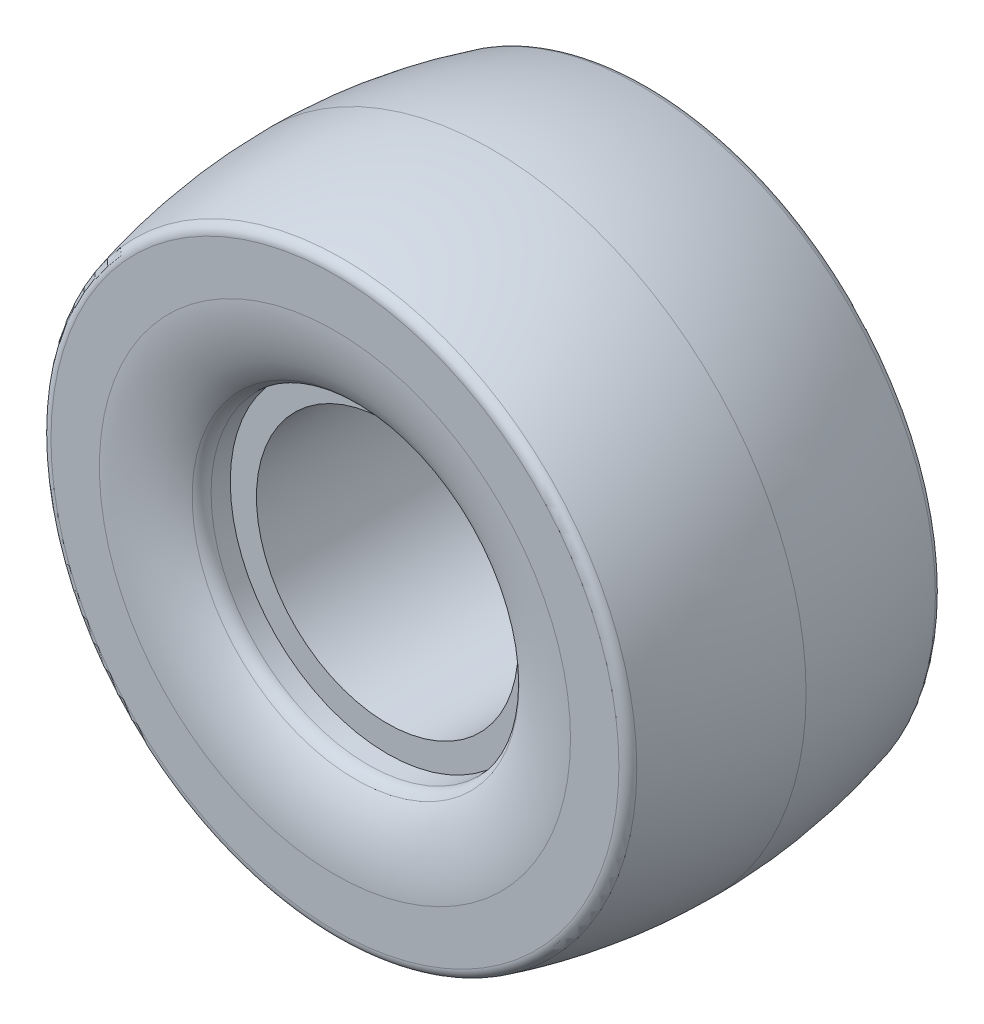
ISO-10303-21;
HEADER;
FILE_DESCRIPTION(('STEP AP214'),'2;1');
FILE_NAME('part.step','',(''),(''),'','','');
FILE_SCHEMA(('AUTOMOTIVE_DESIGN { 1 0 10303 214 1 1 1 1 }'));
ENDSEC;
DATA;
#1=APPLICATION_CONTEXT('core data for automotive mechanical design processes');
#2=APPLICATION_PROTOCOL_DEFINITION('international standard','automotive_design',2000,#1);
#3=PRODUCT_CONTEXT('',#1,'mechanical');
#4=PRODUCT('Part','Part','',(#3));
#5=PRODUCT_RELATED_PRODUCT_CATEGORY('part','',(#4));
#6=PRODUCT_DEFINITION_FORMATION('','',#4);
#7=PRODUCT_DEFINITION_CONTEXT('part definition',#1,'design');
#8=PRODUCT_DEFINITION('design','',#6,#7);
#9=PRODUCT_DEFINITION_SHAPE('','',#8);
#10=(LENGTH_UNIT() NAMED_UNIT(*) SI_UNIT(.MILLI.,.METRE.));
#11=(NAMED_UNIT(*) PLANE_ANGLE_UNIT() SI_UNIT($,.RADIAN.));
#12=(NAMED_UNIT(*) SI_UNIT($,.STERADIAN.) SOLID_ANGLE_UNIT());
#13=UNCERTAINTY_MEASURE_WITH_UNIT(LENGTH_MEASURE(1.E-05),#10,'distance_accuracy_value','');
#14=(GEOMETRIC_REPRESENTATION_CONTEXT(3) GLOBAL_UNCERTAINTY_ASSIGNED_CONTEXT((#13)) GLOBAL_UNIT_ASSIGNED_CONTEXT((#10,
#11,#12)) REPRESENTATION_CONTEXT('',''));
#15=CARTESIAN_POINT('',(0.,0.,0.));
#16=DIRECTION('',(0.,0.,1.));
#17=DIRECTION('',(1.,0.,0.));
#18=AXIS2_PLACEMENT_3D('',#15,#16,#17);
#19=CARTESIAN_POINT('',(0.,25.,20.));
#20=DIRECTION('',(0.,0.,-1.));
#21=DIRECTION('',(-1.,0.,0.));
#22=AXIS2_PLACEMENT_3D('',#19,#20,#21);
#23=PLANE('',#22);
#24=CARTESIAN_POINT('',(0.,0.,20.));
#25=DIRECTION('',(0.,0.,1.));
#26=DIRECTION('',(1.,0.,0.));
#27=AXIS2_PLACEMENT_3D('',#24,#25,#26);
#28=CIRCLE('',#27,25.);
#29=CARTESIAN_POINT('',(25.,0.,20.));
#30=VERTEX_POINT('',#29);
#31=EDGE_CURVE('E82',#30,#30,#28,.T.);
#32=ORIENTED_EDGE('',*,*,#31,.F.);
#33=EDGE_LOOP('',(#32));
#34=FACE_BOUND('',#33,.T.);
#35=CARTESIAN_POINT('',(0.,0.,20.));
#36=DIRECTION('',(0.,0.,1.));
#37=DIRECTION('',(1.,0.,0.));
#38=AXIS2_PLACEMENT_3D('',#35,#36,#37);
#39=CIRCLE('',#38,30.);
#40=CARTESIAN_POINT('',(30.,0.,20.));
#41=VERTEX_POINT('',#40);
#42=EDGE_CURVE('E10',#41,#41,#39,.T.);
#43=ORIENTED_EDGE('',*,*,#42,.T.);
#44=EDGE_LOOP('',(#43));
#45=FACE_BOUND('',#44,.T.);
#46=ADVANCED_FACE('F33',(#34,#45),#23,.F.);
#47=CARTESIAN_POINT('',(0.,0.,30.));
#48=DIRECTION('',(0.,0.,1.));
#49=DIRECTION('',(1.,0.,0.));
#50=AXIS2_PLACEMENT_3D('',#47,#48,#49);
#51=CYLINDRICAL_SURFACE('',#50,30.);
#52=ORIENTED_EDGE('',*,*,#42,.F.);
#53=EDGE_LOOP('',(#52));
#54=FACE_BOUND('',#53,.T.);
#55=CARTESIAN_POINT('',(0.,0.,23.668508033315));
#56=DIRECTION('',(0.,0.,1.));
#57=DIRECTION('',(1.,0.,0.));
#58=AXIS2_PLACEMENT_3D('',#55,#56,#57);
#59=CIRCLE('',#58,30.);
#60=CARTESIAN_POINT('',(30.,0.,23.668508033315));
#61=VERTEX_POINT('',#60);
#62=EDGE_CURVE('E39',#61,#61,#59,.T.);
#63=ORIENTED_EDGE('',*,*,#62,.T.);
#64=EDGE_LOOP('',(#63));
#65=FACE_BOUND('',#64,.T.);
#66=ADVANCED_FACE('F106',(#54,#65),#51,.F.);
#67=CARTESIAN_POINT('',(0.,0.,23.668508033315));
#68=DIRECTION('',(0.,0.,1.));
#69=DIRECTION('',(1.,0.,0.));
#70=AXIS2_PLACEMENT_3D('',#67,#68,#69);
#71=TOROIDAL_SURFACE('',#70,33.,3.00000000000001);
#72=ORIENTED_EDGE('',*,*,#62,.F.);
#73=EDGE_LOOP('',(#72));
#74=FACE_BOUND('',#73,.T.);
#75=CARTESIAN_POINT('',(0.,0.,26.074101645712));
#76=DIRECTION('',(0.,0.,1.));
#77=DIRECTION('',(1.,0.,0.));
#78=AXIS2_PLACEMENT_3D('',#75,#76,#77);
#79=CIRCLE('',#78,31.2074823928355);
#80=CARTESIAN_POINT('',(31.2074823928355,0.,26.074101645712));
#81=VERTEX_POINT('',#80);
#82=EDGE_CURVE('E43',#81,#81,#79,.T.);
#83=ORIENTED_EDGE('',*,*,#82,.T.);
#84=EDGE_LOOP('',(#83));
#85=FACE_BOUND('',#84,.T.);
#86=ADVANCED_FACE('F102',(#74,#85),#71,.T.);
#87=CARTESIAN_POINT('',(0.,45.,30.));
#88=CARTESIAN_POINT('',(0.,42.6861559304344,30.));
#89=CARTESIAN_POINT('',(0.,37.4315997394432,29.2603583772244));
#90=CARTESIAN_POINT('',(0.,32.8491850054114,27.297409200074));
#91=CARTESIAN_POINT('',(0.,31.2074823928355,26.074101645712));
#92=B_SPLINE_CURVE_WITH_KNOTS('',3,(#87,#88,#89,#90,#91),.UNSPECIFIED.,.F.,.F.,(4,1,4),(0.,
0.439021044618023,0.878042089236046),.UNSPECIFIED.);
#93=CARTESIAN_POINT('',(0.,0.,30.));
#94=DIRECTION('',(0.,0.,1.));
#95=AXIS1_PLACEMENT('',#93,#94);
#96=SURFACE_OF_REVOLUTION('',#92,#95);
#97=ORIENTED_EDGE('',*,*,#82,.F.);
#98=EDGE_LOOP('',(#97));
#99=FACE_BOUND('',#98,.T.);
#100=CARTESIAN_POINT('',(0.,0.,30.));
#101=DIRECTION('',(0.,0.,1.));
#102=DIRECTION('',(1.,0.,0.));
#103=AXIS2_PLACEMENT_3D('',#100,#101,#102);
#104=CIRCLE('',#103,45.);
#105=CARTESIAN_POINT('',(45.,0.,30.));
#106=VERTEX_POINT('',#105);
#107=EDGE_CURVE('E47',#106,#106,#104,.T.);
#108=ORIENTED_EDGE('',*,*,#107,.T.);
#109=EDGE_LOOP('',(#108));
#110=FACE_BOUND('',#109,.T.);
#111=ADVANCED_FACE('F97',(#99,#110),#96,.T.);
#112=CARTESIAN_POINT('',(0.,54.2456211986775,30.));
#113=DIRECTION('',(0.,0.,-1.));
#114=DIRECTION('',(-1.,0.,0.));
#115=AXIS2_PLACEMENT_3D('',#112,#113,#114);
#116=PLANE('',#115);
#117=ORIENTED_EDGE('',*,*,#107,.F.);
#118=EDGE_LOOP('',(#117));
#119=FACE_BOUND('',#118,.T.);
#120=CARTESIAN_POINT('',(0.,0.,30.));
#121=DIRECTION('',(0.,0.,1.));
#122=DIRECTION('',(1.,0.,0.));
#123=AXIS2_PLACEMENT_3D('',#120,#121,#122);
#124=CIRCLE('',#123,54.2456211986775);
#125=CARTESIAN_POINT('',(54.2456211986775,0.,30.));
#126=VERTEX_POINT('',#125);
#127=EDGE_CURVE('E52',#126,#126,#124,.T.);
#128=ORIENTED_EDGE('',*,*,#127,.T.);
#129=EDGE_LOOP('',(#128));
#130=FACE_BOUND('',#129,.T.);
#131=ADVANCED_FACE('F101',(#119,#130),#116,.F.);
#132=CARTESIAN_POINT('',(0.,0.,28.));
#133=DIRECTION('',(0.,0.,1.));
#134=DIRECTION('',(1.,0.,0.));
#135=AXIS2_PLACEMENT_3D('',#132,#133,#134);
#136=TOROIDAL_SURFACE('',#135,54.2456211986775,2.);
#137=ORIENTED_EDGE('',*,*,#127,.F.);
#138=EDGE_LOOP('',(#137));
#139=FACE_BOUND('',#138,.T.);
#140=CARTESIAN_POINT('',(0.,0.,28.51788086221));
#141=DIRECTION('',(0.,0.,1.));
#142=DIRECTION('',(1.,0.,0.));
#143=AXIS2_PLACEMENT_3D('',#140,#141,#142);
#144=CIRCLE('',#143,56.1774077843428);
#145=CARTESIAN_POINT('',(56.1774077843428,0.,28.51788086221));
#146=VERTEX_POINT('',#145);
#147=EDGE_CURVE('E55',#146,#146,#144,.T.);
#148=ORIENTED_EDGE('',*,*,#147,.T.);
#149=EDGE_LOOP('',(#148));
#150=FACE_BOUND('',#149,.T.);
#151=ADVANCED_FACE('F165',(#139,#150),#136,.T.);
#152=CARTESIAN_POINT('',(0.,60.,0.));
#153=CARTESIAN_POINT('',(0.,59.9999999999986,4.75298014370305));
#154=CARTESIAN_POINT('',(0.,59.3629012973828,14.2589404311289));
#155=CARTESIAN_POINT('',(0.,57.4516051895622,23.764900718499));
#156=CARTESIAN_POINT('',(0.,56.1774077843428,28.51788086221));
#157=B_SPLINE_CURVE_WITH_KNOTS('',3,(#152,#153,#154,#155,#156),.UNSPECIFIED.,.F.,.F.,(4,1,4),
(0.0247019856292679,0.262350992814421,0.499999999999573),.UNSPECIFIED.);
#158=CARTESIAN_POINT('',(0.,0.,30.));
#159=DIRECTION('',(0.,0.,1.));
#160=AXIS1_PLACEMENT('',#158,#159);
#161=SURFACE_OF_REVOLUTION('',#157,#160);
#162=ORIENTED_EDGE('',*,*,#147,.F.);
#163=EDGE_LOOP('',(#162));
#164=FACE_BOUND('',#163,.T.);
#165=CARTESIAN_POINT('',(0.,0.,0.));
#166=DIRECTION('',(0.,0.,1.));
#167=DIRECTION('',(1.,0.,0.));
#168=AXIS2_PLACEMENT_3D('',#165,#166,#167);
#169=CIRCLE('',#168,60.);
#170=CARTESIAN_POINT('',(60.,0.,0.));
#171=VERTEX_POINT('',#170);
#172=EDGE_CURVE('E58',#171,#171,#169,.T.);
#173=ORIENTED_EDGE('',*,*,#172,.T.);
#174=EDGE_LOOP('',(#173));
#175=FACE_BOUND('',#174,.T.);
#176=ADVANCED_FACE('F162',(#164,#175),#161,.T.);
#177=CARTESIAN_POINT('',(0.,56.1774077843429,-28.51788086221));
#178=CARTESIAN_POINT('',(0.,57.4516051895622,-23.764900718499));
#179=CARTESIAN_POINT('',(0.,59.3629012973828,-14.2589404311289));
#180=CARTESIAN_POINT('',(0.,59.9999999999986,-4.75298014370305));
#181=CARTESIAN_POINT('',(0.,60.,0.));
#182=B_SPLINE_CURVE_WITH_KNOTS('',3,(#177,#178,#179,#180,#181),.UNSPECIFIED.,.F.,.F.,(4,1,4),
(0.0247019856292679,0.262350992814421,0.499999999999573),.UNSPECIFIED.);
#183=CARTESIAN_POINT('',(0.,0.,30.));
#184=DIRECTION('',(0.,0.,1.));
#185=AXIS1_PLACEMENT('',#183,#184);
#186=SURFACE_OF_REVOLUTION('',#182,#185);
#187=ORIENTED_EDGE('',*,*,#172,.F.);
#188=EDGE_LOOP('',(#187));
#189=FACE_BOUND('',#188,.T.);
#190=CARTESIAN_POINT('',(0.,0.,-28.51788086221));
#191=DIRECTION('',(0.,0.,1.));
#192=DIRECTION('',(1.,0.,0.));
#193=AXIS2_PLACEMENT_3D('',#190,#191,#192);
#194=CIRCLE('',#193,56.1774077843429);
#195=CARTESIAN_POINT('',(56.1774077843429,0.,-28.51788086221));
#196=VERTEX_POINT('',#195);
#197=EDGE_CURVE('E61',#196,#196,#194,.T.);
#198=ORIENTED_EDGE('',*,*,#197,.T.);
#199=EDGE_LOOP('',(#198));
#200=FACE_BOUND('',#199,.T.);
#201=ADVANCED_FACE('F158',(#189,#200),#186,.T.);
#202=CARTESIAN_POINT('',(0.,0.,-28.));
#203=DIRECTION('',(0.,0.,1.));
#204=DIRECTION('',(1.,0.,0.));
#205=AXIS2_PLACEMENT_3D('',#202,#203,#204);
#206=TOROIDAL_SURFACE('',#205,54.2456211986775,2.);
#207=ORIENTED_EDGE('',*,*,#197,.F.);
#208=EDGE_LOOP('',(#207));
#209=FACE_BOUND('',#208,.T.);
#210=CARTESIAN_POINT('',(0.,0.,-30.));
#211=DIRECTION('',(0.,0.,1.));
#212=DIRECTION('',(1.,0.,0.));
#213=AXIS2_PLACEMENT_3D('',#210,#211,#212);
#214=CIRCLE('',#213,54.2456211986775);
#215=CARTESIAN_POINT('',(54.2456211986775,0.,-30.));
#216=VERTEX_POINT('',#215);
#217=EDGE_CURVE('E64',#216,#216,#214,.T.);
#218=ORIENTED_EDGE('',*,*,#217,.T.);
#219=EDGE_LOOP('',(#218));
#220=FACE_BOUND('',#219,.T.);
#221=ADVANCED_FACE('F161',(#209,#220),#206,.T.);
#222=CARTESIAN_POINT('',(0.,54.2456211986775,-30.));
#223=DIRECTION('',(0.,0.,1.));
#224=DIRECTION('',(1.,0.,0.));
#225=AXIS2_PLACEMENT_3D('',#222,#223,#224);
#226=PLANE('',#225);
#227=ORIENTED_EDGE('',*,*,#217,.F.);
#228=EDGE_LOOP('',(#227));
#229=FACE_BOUND('',#228,.T.);
#230=CARTESIAN_POINT('',(0.,0.,-30.));
#231=DIRECTION('',(0.,0.,1.));
#232=DIRECTION('',(1.,0.,0.));
#233=AXIS2_PLACEMENT_3D('',#230,#231,#232);
#234=CIRCLE('',#233,45.);
#235=CARTESIAN_POINT('',(45.,0.,-30.));
#236=VERTEX_POINT('',#235);
#237=EDGE_CURVE('E67',#236,#236,#234,.T.);
#238=ORIENTED_EDGE('',*,*,#237,.T.);
#239=EDGE_LOOP('',(#238));
#240=FACE_BOUND('',#239,.T.);
#241=ADVANCED_FACE('F142',(#229,#240),#226,.F.);
#242=CARTESIAN_POINT('',(0.,31.2074823928356,-26.074101645712));
#243=CARTESIAN_POINT('',(0.,32.8491850054114,-27.297409200074));
#244=CARTESIAN_POINT('',(0.,37.4315997394432,-29.2603583772244));
#245=CARTESIAN_POINT('',(0.,42.6861559304344,-30.));
#246=CARTESIAN_POINT('',(0.,45.,-30.));
#247=B_SPLINE_CURVE_WITH_KNOTS('',3,(#242,#243,#244,#245,#246),.UNSPECIFIED.,.F.,.F.,(4,1,4),
(0.,0.439021044618023,0.878042089236046),.UNSPECIFIED.);
#248=CARTESIAN_POINT('',(0.,0.,30.));
#249=DIRECTION('',(0.,0.,1.));
#250=AXIS1_PLACEMENT('',#248,#249);
#251=SURFACE_OF_REVOLUTION('',#247,#250);
#252=ORIENTED_EDGE('',*,*,#237,.F.);
#253=EDGE_LOOP('',(#252));
#254=FACE_BOUND('',#253,.T.);
#255=CARTESIAN_POINT('',(0.,0.,-26.0741016457121));
#256=DIRECTION('',(0.,0.,1.));
#257=DIRECTION('',(1.,0.,0.));
#258=AXIS2_PLACEMENT_3D('',#255,#256,#257);
#259=CIRCLE('',#258,31.2074823928355);
#260=CARTESIAN_POINT('',(31.2074823928355,0.,-26.0741016457121));
#261=VERTEX_POINT('',#260);
#262=EDGE_CURVE('E70',#261,#261,#259,.T.);
#263=ORIENTED_EDGE('',*,*,#262,.T.);
#264=EDGE_LOOP('',(#263));
#265=FACE_BOUND('',#264,.T.);
#266=ADVANCED_FACE('F137',(#254,#265),#251,.T.);
#267=CARTESIAN_POINT('',(0.,0.,-23.668508033315));
#268=DIRECTION('',(0.,0.,1.));
#269=DIRECTION('',(1.,0.,0.));
#270=AXIS2_PLACEMENT_3D('',#267,#268,#269);
#271=TOROIDAL_SURFACE('',#270,33.,3.00000000000001);
#272=ORIENTED_EDGE('',*,*,#262,.F.);
#273=EDGE_LOOP('',(#272));
#274=FACE_BOUND('',#273,.T.);
#275=CARTESIAN_POINT('',(0.,0.,-23.668508033315));
#276=DIRECTION('',(0.,0.,1.));
#277=DIRECTION('',(1.,0.,0.));
#278=AXIS2_PLACEMENT_3D('',#275,#276,#277);
#279=CIRCLE('',#278,30.);
#280=CARTESIAN_POINT('',(30.,0.,-23.668508033315));
#281=VERTEX_POINT('',#280);
#282=EDGE_CURVE('E73',#281,#281,#279,.T.);
#283=ORIENTED_EDGE('',*,*,#282,.T.);
#284=EDGE_LOOP('',(#283));
#285=FACE_BOUND('',#284,.T.);
#286=ADVANCED_FACE('F133',(#274,#285),#271,.T.);
#287=CARTESIAN_POINT('',(0.,0.,30.));
#288=DIRECTION('',(0.,0.,1.));
#289=DIRECTION('',(1.,0.,0.));
#290=AXIS2_PLACEMENT_3D('',#287,#288,#289);
#291=CYLINDRICAL_SURFACE('',#290,30.);
#292=ORIENTED_EDGE('',*,*,#282,.F.);
#293=EDGE_LOOP('',(#292));
#294=FACE_BOUND('',#293,.T.);
#295=CARTESIAN_POINT('',(0.,0.,-20.));
#296=DIRECTION('',(0.,0.,1.));
#297=DIRECTION('',(1.,0.,0.));
#298=AXIS2_PLACEMENT_3D('',#295,#296,#297);
#299=CIRCLE('',#298,30.);
#300=CARTESIAN_POINT('',(30.,0.,-20.));
#301=VERTEX_POINT('',#300);
#302=EDGE_CURVE('E76',#301,#301,#299,.T.);
#303=ORIENTED_EDGE('',*,*,#302,.T.);
#304=EDGE_LOOP('',(#303));
#305=FACE_BOUND('',#304,.T.);
#306=ADVANCED_FACE('F126',(#294,#305),#291,.F.);
#307=CARTESIAN_POINT('',(0.,25.,-20.));
#308=DIRECTION('',(0.,0.,1.));
#309=DIRECTION('',(1.,0.,0.));
#310=AXIS2_PLACEMENT_3D('',#307,#308,#309);
#311=PLANE('',#310);
#312=ORIENTED_EDGE('',*,*,#302,.F.);
#313=EDGE_LOOP('',(#312));
#314=FACE_BOUND('',#313,.T.);
#315=CARTESIAN_POINT('',(0.,0.,-20.));
#316=DIRECTION('',(0.,0.,1.));
#317=DIRECTION('',(1.,0.,0.));
#318=AXIS2_PLACEMENT_3D('',#315,#316,#317);
#319=CIRCLE('',#318,25.);
#320=CARTESIAN_POINT('',(25.,0.,-20.));
#321=VERTEX_POINT('',#320);
#322=EDGE_CURVE('E79',#321,#321,#319,.T.);
#323=ORIENTED_EDGE('',*,*,#322,.T.);
#324=EDGE_LOOP('',(#323));
#325=FACE_BOUND('',#324,.T.);
#326=ADVANCED_FACE('F120',(#314,#325),#311,.F.);
#327=CARTESIAN_POINT('',(0.,0.,30.));
#328=DIRECTION('',(0.,0.,1.));
#329=DIRECTION('',(1.,0.,0.));
#330=AXIS2_PLACEMENT_3D('',#327,#328,#329);
#331=CYLINDRICAL_SURFACE('',#330,25.);
#332=ORIENTED_EDGE('',*,*,#322,.F.);
#333=EDGE_LOOP('',(#332));
#334=FACE_BOUND('',#333,.T.);
#335=ORIENTED_EDGE('',*,*,#31,.T.);
#336=EDGE_LOOP('',(#335));
#337=FACE_BOUND('',#336,.T.);
#338=ADVANCED_FACE('F118',(#334,#337),#331,.F.);
#339=CLOSED_SHELL('',(#46,#66,#86,#111,#131,#151,#176,#201,#221,#241,#266,#286,#306,#326,#338));
#340=MANIFOLD_SOLID_BREP('B2',#339);
#341=ADVANCED_BREP_SHAPE_REPRESENTATION('',(#18,#340),#14);
#342=SHAPE_DEFINITION_REPRESENTATION(#9,#341);
ENDSEC;
END-ISO-10303-21;
